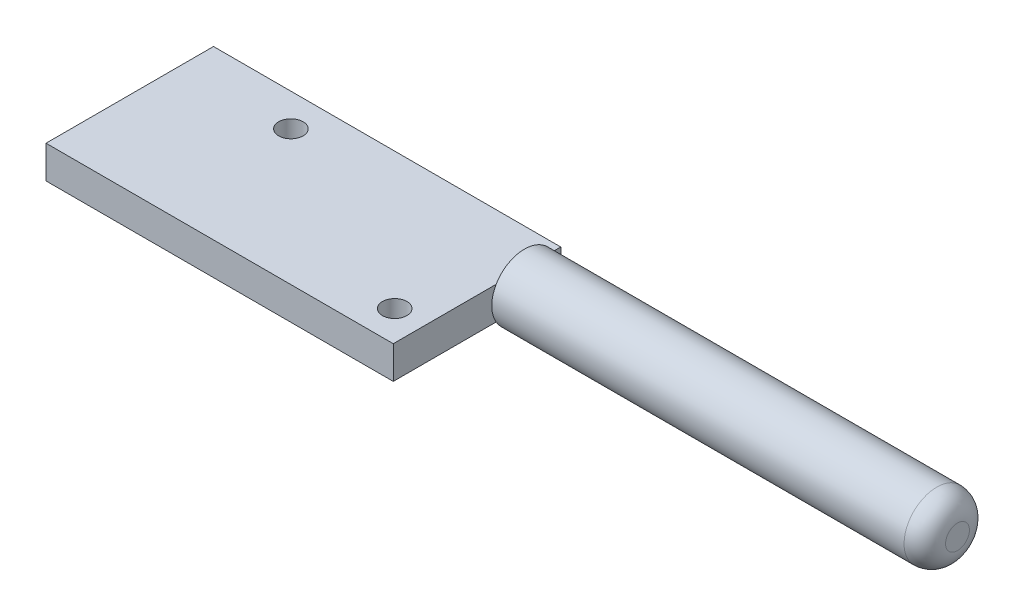
ISO-10303-21;
HEADER;
FILE_DESCRIPTION(('STEP AP214'),'2;1');
FILE_NAME('part.step','',(''),(''),'','','');
FILE_SCHEMA(('AUTOMOTIVE_DESIGN { 1 0 10303 214 1 1 1 1 }'));
ENDSEC;
DATA;
#1=APPLICATION_CONTEXT('core data for automotive mechanical design processes');
#2=APPLICATION_PROTOCOL_DEFINITION('international standard','automotive_design',2000,#1);
#3=PRODUCT_CONTEXT('',#1,'mechanical');
#4=PRODUCT('Part','Part','',(#3));
#5=PRODUCT_RELATED_PRODUCT_CATEGORY('part','',(#4));
#6=PRODUCT_DEFINITION_FORMATION('','',#4);
#7=PRODUCT_DEFINITION_CONTEXT('part definition',#1,'design');
#8=PRODUCT_DEFINITION('design','',#6,#7);
#9=PRODUCT_DEFINITION_SHAPE('','',#8);
#10=(LENGTH_UNIT() NAMED_UNIT(*) SI_UNIT(.MILLI.,.METRE.));
#11=(NAMED_UNIT(*) PLANE_ANGLE_UNIT() SI_UNIT($,.RADIAN.));
#12=(NAMED_UNIT(*) SI_UNIT($,.STERADIAN.) SOLID_ANGLE_UNIT());
#13=UNCERTAINTY_MEASURE_WITH_UNIT(LENGTH_MEASURE(1.E-05),#10,'distance_accuracy_value','');
#14=(GEOMETRIC_REPRESENTATION_CONTEXT(3) GLOBAL_UNCERTAINTY_ASSIGNED_CONTEXT((#13)) GLOBAL_UNIT_ASSIGNED_CONTEXT((#10,
#11,#12)) REPRESENTATION_CONTEXT('',''));
#15=CARTESIAN_POINT('',(0.,0.,0.));
#16=DIRECTION('',(0.,0.,1.));
#17=DIRECTION('',(1.,0.,0.));
#18=AXIS2_PLACEMENT_3D('',#15,#16,#17);
#19=CARTESIAN_POINT('',(21.25,4.,10.25));
#20=DIRECTION('',(-1.,0.,0.));
#21=DIRECTION('',(0.,0.,1.));
#22=AXIS2_PLACEMENT_3D('',#19,#20,#21);
#23=PLANE('',#22);
#24=CARTESIAN_POINT('',(21.25,2.,-5.80441042495566));
#25=DIRECTION('',(1.,0.,0.));
#26=DIRECTION('',(0.,0.,-1.));
#27=AXIS2_PLACEMENT_3D('',#24,#25,#26);
#28=CIRCLE('',#27,4.);
#29=CARTESIAN_POINT('',(21.25,4.,-2.34030880981791));
#30=VERTEX_POINT('',#29);
#31=CARTESIAN_POINT('',(21.25,0.,-2.34030880981791));
#32=VERTEX_POINT('',#31);
#33=EDGE_CURVE('E63',#30,#32,#28,.T.);
#34=ORIENTED_EDGE('',*,*,#33,.F.);
#35=DIRECTION('',(0.,0.,-1.));
#36=VECTOR('',#35,1.);
#37=CARTESIAN_POINT('',(21.25,4.,10.25));
#38=LINE('',#37,#36);
#39=CARTESIAN_POINT('',(21.25,4.,10.25));
#40=VERTEX_POINT('',#39);
#41=EDGE_CURVE('E107',#40,#30,#38,.T.);
#42=ORIENTED_EDGE('',*,*,#41,.F.);
#43=DIRECTION('',(0.,-1.,0.));
#44=VECTOR('',#43,1.);
#45=CARTESIAN_POINT('',(21.25,4.,10.25));
#46=LINE('',#45,#44);
#47=CARTESIAN_POINT('',(21.25,0.,10.25));
#48=VERTEX_POINT('',#47);
#49=EDGE_CURVE('E148',#40,#48,#46,.T.);
#50=ORIENTED_EDGE('',*,*,#49,.T.);
#51=DIRECTION('',(0.,0.,-1.));
#52=VECTOR('',#51,1.);
#53=CARTESIAN_POINT('',(21.25,0.,10.25));
#54=LINE('',#53,#52);
#55=EDGE_CURVE('E134',#48,#32,#54,.T.);
#56=ORIENTED_EDGE('',*,*,#55,.T.);
#57=EDGE_LOOP('',(#34,#42,#50,#56));
#58=FACE_BOUND('',#57,.T.);
#59=ADVANCED_FACE('F45',(#58),#23,.F.);
#60=CARTESIAN_POINT('',(21.25,0.,-9.26851204009342));
#61=VERTEX_POINT('',#60);
#62=CARTESIAN_POINT('',(21.25,4.,-9.26851204009342));
#63=VERTEX_POINT('',#62);
#64=EDGE_CURVE('E71',#61,#63,#28,.T.);
#65=ORIENTED_EDGE('',*,*,#64,.F.);
#66=CARTESIAN_POINT('',(21.25,0.,-10.25));
#67=VERTEX_POINT('',#66);
#68=EDGE_CURVE('E129',#61,#67,#54,.T.);
#69=ORIENTED_EDGE('',*,*,#68,.T.);
#70=DIRECTION('',(0.,-1.,0.));
#71=VECTOR('',#70,1.);
#72=CARTESIAN_POINT('',(21.25,4.,-10.25));
#73=LINE('',#72,#71);
#74=CARTESIAN_POINT('',(21.25,4.,-10.25));
#75=VERTEX_POINT('',#74);
#76=EDGE_CURVE('E116',#75,#67,#73,.T.);
#77=ORIENTED_EDGE('',*,*,#76,.F.);
#78=EDGE_CURVE('E105',#63,#75,#38,.T.);
#79=ORIENTED_EDGE('',*,*,#78,.F.);
#80=EDGE_LOOP('',(#65,#69,#77,#79));
#81=FACE_BOUND('',#80,.T.);
#82=ADVANCED_FACE('F114',(#81),#23,.F.);
#83=CARTESIAN_POINT('',(-21.25,4.,-10.25));
#84=DIRECTION('',(0.,0.,1.));
#85=DIRECTION('',(1.,0.,0.));
#86=AXIS2_PLACEMENT_3D('',#83,#84,#85);
#87=PLANE('',#86);
#88=DIRECTION('',(-1.,0.,0.));
#89=VECTOR('',#88,1.);
#90=CARTESIAN_POINT('',(-21.25,0.,-10.25));
#91=LINE('',#90,#89);
#92=CARTESIAN_POINT('',(-21.25,0.,-10.25));
#93=VERTEX_POINT('',#92);
#94=EDGE_CURVE('E151',#67,#93,#91,.T.);
#95=ORIENTED_EDGE('',*,*,#94,.T.);
#96=DIRECTION('',(0.,-1.,0.));
#97=VECTOR('',#96,1.);
#98=CARTESIAN_POINT('',(-21.25,4.,-10.25));
#99=LINE('',#98,#97);
#100=CARTESIAN_POINT('',(-21.25,4.,-10.25));
#101=VERTEX_POINT('',#100);
#102=EDGE_CURVE('E166',#101,#93,#99,.T.);
#103=ORIENTED_EDGE('',*,*,#102,.F.);
#104=DIRECTION('',(-1.,0.,0.));
#105=VECTOR('',#104,1.);
#106=CARTESIAN_POINT('',(-21.25,4.,-10.25));
#107=LINE('',#106,#105);
#108=EDGE_CURVE('E140',#75,#101,#107,.T.);
#109=ORIENTED_EDGE('',*,*,#108,.F.);
#110=ORIENTED_EDGE('',*,*,#76,.T.);
#111=EDGE_LOOP('',(#95,#103,#109,#110));
#112=FACE_BOUND('',#111,.T.);
#113=ADVANCED_FACE('F213',(#112),#87,.F.);
#114=CARTESIAN_POINT('',(-21.25,4.,10.25));
#115=DIRECTION('',(1.,0.,0.));
#116=DIRECTION('',(0.,0.,-1.));
#117=AXIS2_PLACEMENT_3D('',#114,#115,#116);
#118=PLANE('',#117);
#119=DIRECTION('',(0.,0.,1.));
#120=VECTOR('',#119,1.);
#121=CARTESIAN_POINT('',(-21.25,0.,10.25));
#122=LINE('',#121,#120);
#123=CARTESIAN_POINT('',(-21.25,0.,10.25));
#124=VERTEX_POINT('',#123);
#125=EDGE_CURVE('E154',#93,#124,#122,.T.);
#126=ORIENTED_EDGE('',*,*,#125,.T.);
#127=DIRECTION('',(0.,-1.,0.));
#128=VECTOR('',#127,1.);
#129=CARTESIAN_POINT('',(-21.25,4.,10.25));
#130=LINE('',#129,#128);
#131=CARTESIAN_POINT('',(-21.25,4.,10.25));
#132=VERTEX_POINT('',#131);
#133=EDGE_CURVE('E162',#132,#124,#130,.T.);
#134=ORIENTED_EDGE('',*,*,#133,.F.);
#135=DIRECTION('',(0.,0.,1.));
#136=VECTOR('',#135,1.);
#137=CARTESIAN_POINT('',(-21.25,4.,10.25));
#138=LINE('',#137,#136);
#139=EDGE_CURVE('E143',#101,#132,#138,.T.);
#140=ORIENTED_EDGE('',*,*,#139,.F.);
#141=ORIENTED_EDGE('',*,*,#102,.T.);
#142=EDGE_LOOP('',(#126,#134,#140,#141));
#143=FACE_BOUND('',#142,.T.);
#144=ADVANCED_FACE('F205',(#143),#118,.F.);
#145=CARTESIAN_POINT('',(-21.25,4.,10.25));
#146=DIRECTION('',(0.,0.,-1.));
#147=DIRECTION('',(-1.,0.,0.));
#148=AXIS2_PLACEMENT_3D('',#145,#146,#147);
#149=PLANE('',#148);
#150=DIRECTION('',(1.,0.,0.));
#151=VECTOR('',#150,1.);
#152=CARTESIAN_POINT('',(-21.25,0.,10.25));
#153=LINE('',#152,#151);
#154=EDGE_CURVE('E118',#124,#48,#153,.T.);
#155=ORIENTED_EDGE('',*,*,#154,.T.);
#156=ORIENTED_EDGE('',*,*,#49,.F.);
#157=DIRECTION('',(1.,0.,0.));
#158=VECTOR('',#157,1.);
#159=CARTESIAN_POINT('',(-21.25,4.,10.25));
#160=LINE('',#159,#158);
#161=EDGE_CURVE('E146',#132,#40,#160,.T.);
#162=ORIENTED_EDGE('',*,*,#161,.F.);
#163=ORIENTED_EDGE('',*,*,#133,.T.);
#164=EDGE_LOOP('',(#155,#156,#162,#163));
#165=FACE_BOUND('',#164,.T.);
#166=ADVANCED_FACE('F194',(#165),#149,.F.);
#167=CARTESIAN_POINT('',(0.,4.,0.));
#168=DIRECTION('',(0.,-1.,0.));
#169=DIRECTION('',(0.,0.,-1.));
#170=AXIS2_PLACEMENT_3D('',#167,#168,#169);
#171=PLANE('',#170);
#172=CARTESIAN_POINT('',(17.612,4.,6.44));
#173=DIRECTION('',(0.,1.,0.));
#174=DIRECTION('',(0.,0.,1.));
#175=AXIS2_PLACEMENT_3D('',#172,#173,#174);
#176=CIRCLE('',#175,1.5);
#177=CARTESIAN_POINT('',(17.612,4.,7.94));
#178=VERTEX_POINT('',#177);
#179=EDGE_CURVE('E177',#178,#178,#176,.T.);
#180=ORIENTED_EDGE('',*,*,#179,.F.);
#181=EDGE_LOOP('',(#180));
#182=FACE_BOUND('',#181,.T.);
#183=CARTESIAN_POINT('',(-7.788,4.,-6.26));
#184=DIRECTION('',(0.,1.,0.));
#185=DIRECTION('',(0.,0.,1.));
#186=AXIS2_PLACEMENT_3D('',#183,#184,#185);
#187=CIRCLE('',#186,1.5);
#188=CARTESIAN_POINT('',(-7.788,4.,-4.76));
#189=VERTEX_POINT('',#188);
#190=EDGE_CURVE('E136',#189,#189,#187,.T.);
#191=ORIENTED_EDGE('',*,*,#190,.F.);
#192=EDGE_LOOP('',(#191));
#193=FACE_BOUND('',#192,.T.);
#194=ORIENTED_EDGE('',*,*,#41,.T.);
#195=EDGE_CURVE('E103',#30,#63,#38,.T.);
#196=ORIENTED_EDGE('',*,*,#195,.T.);
#197=ORIENTED_EDGE('',*,*,#78,.T.);
#198=ORIENTED_EDGE('',*,*,#108,.T.);
#199=ORIENTED_EDGE('',*,*,#139,.T.);
#200=ORIENTED_EDGE('',*,*,#161,.T.);
#201=EDGE_LOOP('',(#194,#196,#197,#198,#199,#200));
#202=FACE_BOUND('',#201,.T.);
#203=ADVANCED_FACE('F104',(#182,#193,#202),#171,.F.);
#204=CARTESIAN_POINT('',(0.,0.,0.));
#205=DIRECTION('',(0.,-1.,0.));
#206=DIRECTION('',(0.,0.,-1.));
#207=AXIS2_PLACEMENT_3D('',#204,#205,#206);
#208=PLANE('',#207);
#209=CARTESIAN_POINT('',(17.612,0.,6.44));
#210=DIRECTION('',(0.,-1.,0.));
#211=DIRECTION('',(0.,0.,-1.));
#212=AXIS2_PLACEMENT_3D('',#209,#210,#211);
#213=CIRCLE('',#212,1.5);
#214=CARTESIAN_POINT('',(17.612,0.,4.94));
#215=VERTEX_POINT('',#214);
#216=EDGE_CURVE('E49',#215,#215,#213,.T.);
#217=ORIENTED_EDGE('',*,*,#216,.F.);
#218=EDGE_LOOP('',(#217));
#219=FACE_BOUND('',#218,.T.);
#220=CARTESIAN_POINT('',(-7.788,0.,-6.26));
#221=DIRECTION('',(0.,-1.,0.));
#222=DIRECTION('',(0.,0.,-1.));
#223=AXIS2_PLACEMENT_3D('',#220,#221,#222);
#224=CIRCLE('',#223,1.5);
#225=CARTESIAN_POINT('',(-7.788,0.,-7.76));
#226=VERTEX_POINT('',#225);
#227=EDGE_CURVE('E174',#226,#226,#224,.T.);
#228=ORIENTED_EDGE('',*,*,#227,.F.);
#229=EDGE_LOOP('',(#228));
#230=FACE_BOUND('',#229,.T.);
#231=ORIENTED_EDGE('',*,*,#55,.F.);
#232=ORIENTED_EDGE('',*,*,#154,.F.);
#233=ORIENTED_EDGE('',*,*,#125,.F.);
#234=ORIENTED_EDGE('',*,*,#94,.F.);
#235=ORIENTED_EDGE('',*,*,#68,.F.);
#236=EDGE_CURVE('E132',#32,#61,#54,.T.);
#237=ORIENTED_EDGE('',*,*,#236,.F.);
#238=EDGE_LOOP('',(#231,#232,#233,#234,#235,#237));
#239=FACE_BOUND('',#238,.T.);
#240=ADVANCED_FACE('F193',(#219,#230,#239),#208,.T.);
#241=CARTESIAN_POINT('',(21.25,2.,-5.80441042495566));
#242=DIRECTION('',(1.,0.,0.));
#243=DIRECTION('',(0.,0.,-1.));
#244=AXIS2_PLACEMENT_3D('',#241,#242,#243);
#245=PLANE('',#244);
#246=EDGE_CURVE('E124',#32,#61,#28,.T.);
#247=ORIENTED_EDGE('',*,*,#246,.F.);
#248=ORIENTED_EDGE('',*,*,#236,.T.);
#249=EDGE_LOOP('',(#247,#248));
#250=FACE_BOUND('',#249,.T.);
#251=ADVANCED_FACE('F201',(#250),#245,.F.);
#252=CARTESIAN_POINT('',(74.25,2.,-5.80441042495566));
#253=DIRECTION('',(-1.,0.,0.));
#254=DIRECTION('',(0.,0.,1.));
#255=AXIS2_PLACEMENT_3D('',#252,#253,#254);
#256=CYLINDRICAL_SURFACE('',#255,4.);
#257=CARTESIAN_POINT('',(71.71,2.,-5.80441042495566));
#258=DIRECTION('',(1.,0.,0.));
#259=DIRECTION('',(0.,0.,-1.));
#260=AXIS2_PLACEMENT_3D('',#257,#258,#259);
#261=CIRCLE('',#260,4.);
#262=CARTESIAN_POINT('',(71.71,2.,-9.80441042495566));
#263=VERTEX_POINT('',#262);
#264=EDGE_CURVE('E11',#263,#263,#261,.F.);
#265=ORIENTED_EDGE('',*,*,#264,.T.);
#266=EDGE_LOOP('',(#265));
#267=FACE_BOUND('',#266,.T.);
#268=EDGE_CURVE('E122',#63,#30,#28,.T.);
#269=ORIENTED_EDGE('',*,*,#268,.T.);
#270=ORIENTED_EDGE('',*,*,#33,.T.);
#271=ORIENTED_EDGE('',*,*,#246,.T.);
#272=ORIENTED_EDGE('',*,*,#64,.T.);
#273=EDGE_LOOP('',(#269,#270,#271,#272));
#274=FACE_BOUND('',#273,.T.);
#275=ADVANCED_FACE('F121',(#267,#274),#256,.T.);
#276=CARTESIAN_POINT('',(74.25,2.,-5.80441042495566));
#277=DIRECTION('',(1.,0.,0.));
#278=DIRECTION('',(0.,0.,-1.));
#279=AXIS2_PLACEMENT_3D('',#276,#277,#278);
#280=PLANE('',#279);
#281=CARTESIAN_POINT('',(74.25,2.,-5.80441042495566));
#282=DIRECTION('',(1.,0.,0.));
#283=DIRECTION('',(0.,0.,-1.));
#284=AXIS2_PLACEMENT_3D('',#281,#282,#283);
#285=CIRCLE('',#284,1.46);
#286=CARTESIAN_POINT('',(74.25,2.,-7.26441042495567));
#287=VERTEX_POINT('',#286);
#288=EDGE_CURVE('E55',#287,#287,#285,.T.);
#289=ORIENTED_EDGE('',*,*,#288,.T.);
#290=EDGE_LOOP('',(#289));
#291=FACE_BOUND('',#290,.T.);
#292=ADVANCED_FACE('F242',(#291),#280,.T.);
#293=ORIENTED_EDGE('',*,*,#195,.F.);
#294=ORIENTED_EDGE('',*,*,#268,.F.);
#295=EDGE_LOOP('',(#293,#294));
#296=FACE_BOUND('',#295,.T.);
#297=ADVANCED_FACE('F127',(#296),#245,.F.);
#298=CARTESIAN_POINT('',(71.71,2.,-5.80441042495566));
#299=DIRECTION('',(1.,0.,0.));
#300=DIRECTION('',(0.,0.,-1.));
#301=AXIS2_PLACEMENT_3D('',#298,#299,#300);
#302=DEGENERATE_TOROIDAL_SURFACE('',#301,1.46,2.54,.T.);
#303=ORIENTED_EDGE('',*,*,#264,.F.);
#304=EDGE_LOOP('',(#303));
#305=FACE_BOUND('',#304,.T.);
#306=ORIENTED_EDGE('',*,*,#288,.F.);
#307=EDGE_LOOP('',(#306));
#308=FACE_BOUND('',#307,.T.);
#309=ADVANCED_FACE('F47',(#305,#308),#302,.T.);
#310=CARTESIAN_POINT('',(-7.788,-2.,-6.26));
#311=DIRECTION('',(0.,1.,0.));
#312=DIRECTION('',(0.,0.,1.));
#313=AXIS2_PLACEMENT_3D('',#310,#311,#312);
#314=CYLINDRICAL_SURFACE('',#313,1.5);
#315=ORIENTED_EDGE('',*,*,#227,.T.);
#316=EDGE_LOOP('',(#315));
#317=FACE_BOUND('',#316,.T.);
#318=ORIENTED_EDGE('',*,*,#190,.T.);
#319=EDGE_LOOP('',(#318));
#320=FACE_BOUND('',#319,.T.);
#321=ADVANCED_FACE('F190',(#317,#320),#314,.F.);
#322=CARTESIAN_POINT('',(17.612,-2.,6.44));
#323=DIRECTION('',(0.,1.,0.));
#324=DIRECTION('',(0.,0.,1.));
#325=AXIS2_PLACEMENT_3D('',#322,#323,#324);
#326=CYLINDRICAL_SURFACE('',#325,1.5);
#327=ORIENTED_EDGE('',*,*,#216,.T.);
#328=EDGE_LOOP('',(#327));
#329=FACE_BOUND('',#328,.T.);
#330=ORIENTED_EDGE('',*,*,#179,.T.);
#331=EDGE_LOOP('',(#330));
#332=FACE_BOUND('',#331,.T.);
#333=ADVANCED_FACE('F255',(#329,#332),#326,.F.);
#334=CLOSED_SHELL('',(#59,#82,#113,#144,#166,#203,#240,#251,#275,#292,#297,#309,#321,#333));
#335=MANIFOLD_SOLID_BREP('B2',#334);
#336=ADVANCED_BREP_SHAPE_REPRESENTATION('',(#18,#335),#14);
#337=SHAPE_DEFINITION_REPRESENTATION(#9,#336);
ENDSEC;
END-ISO-10303-21;
